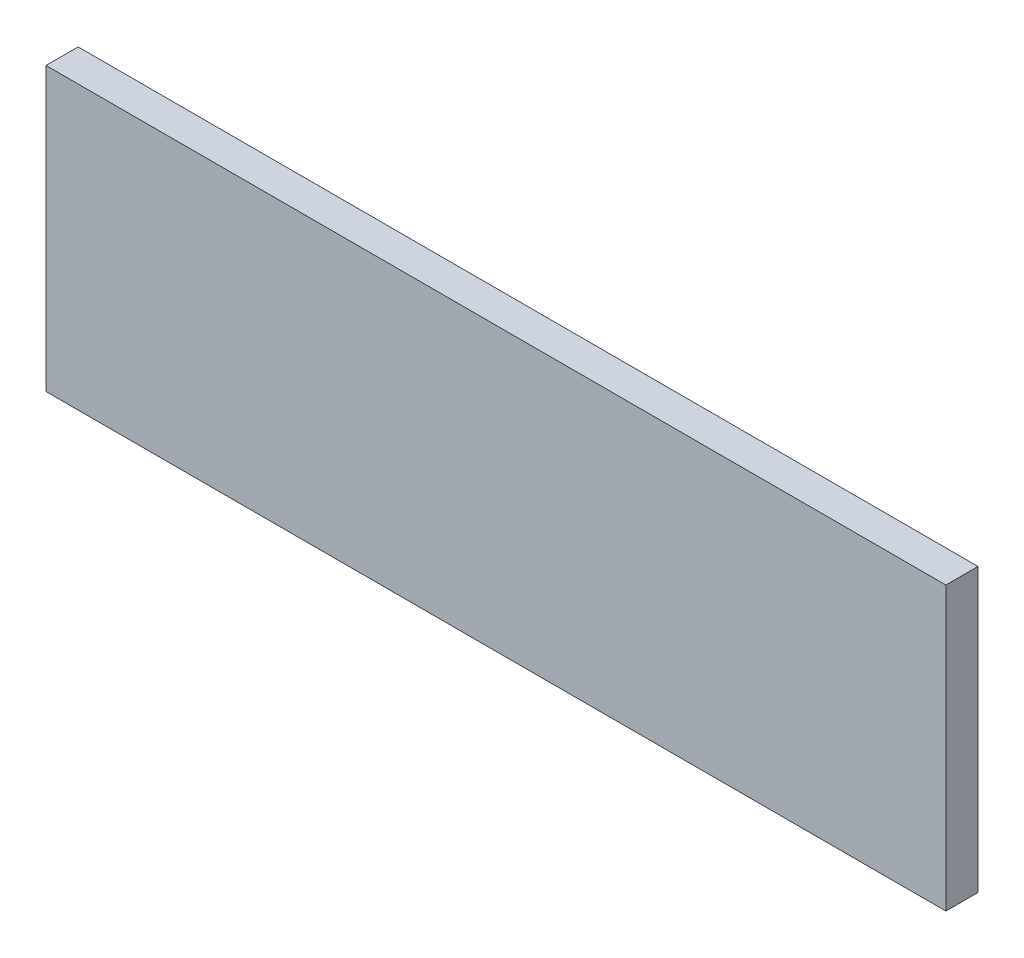
ISO-10303-21;
HEADER;
FILE_DESCRIPTION(('STEP AP214'),'2;1');
FILE_NAME('part.step','',(''),(''),'','','');
FILE_SCHEMA(('AUTOMOTIVE_DESIGN { 1 0 10303 214 1 1 1 1 }'));
ENDSEC;
DATA;
#1=APPLICATION_CONTEXT('core data for automotive mechanical design processes');
#2=APPLICATION_PROTOCOL_DEFINITION('international standard','automotive_design',2000,#1);
#3=PRODUCT_CONTEXT('',#1,'mechanical');
#4=PRODUCT('Part','Part','',(#3));
#5=PRODUCT_RELATED_PRODUCT_CATEGORY('part','',(#4));
#6=PRODUCT_DEFINITION_FORMATION('','',#4);
#7=PRODUCT_DEFINITION_CONTEXT('part definition',#1,'design');
#8=PRODUCT_DEFINITION('design','',#6,#7);
#9=PRODUCT_DEFINITION_SHAPE('','',#8);
#10=(LENGTH_UNIT() NAMED_UNIT(*) SI_UNIT(.MILLI.,.METRE.));
#11=(NAMED_UNIT(*) PLANE_ANGLE_UNIT() SI_UNIT($,.RADIAN.));
#12=(NAMED_UNIT(*) SI_UNIT($,.STERADIAN.) SOLID_ANGLE_UNIT());
#13=UNCERTAINTY_MEASURE_WITH_UNIT(LENGTH_MEASURE(1.E-05),#10,'distance_accuracy_value','');
#14=(GEOMETRIC_REPRESENTATION_CONTEXT(3) GLOBAL_UNCERTAINTY_ASSIGNED_CONTEXT((#13)) GLOBAL_UNIT_ASSIGNED_CONTEXT((#10,
#11,#12)) REPRESENTATION_CONTEXT('',''));
#15=CARTESIAN_POINT('',(0.,0.,0.));
#16=DIRECTION('',(0.,0.,1.));
#17=DIRECTION('',(1.,0.,0.));
#18=AXIS2_PLACEMENT_3D('',#15,#16,#17);
#19=CARTESIAN_POINT('',(88.8999999999997,-27.9000000000001,3.175));
#20=DIRECTION('',(-1.,0.,0.));
#21=DIRECTION('',(0.,0.,1.));
#22=AXIS2_PLACEMENT_3D('',#19,#20,#21);
#23=PLANE('',#22);
#24=DIRECTION('',(0.,1.,0.));
#25=VECTOR('',#24,1.);
#26=CARTESIAN_POINT('',(88.8999999999997,-27.9000000000001,-3.175));
#27=LINE('',#26,#25);
#28=CARTESIAN_POINT('',(88.8999999999997,-27.9000000000001,-3.175));
#29=VERTEX_POINT('',#28);
#30=CARTESIAN_POINT('',(88.8999999999997,27.8999999999997,-3.175));
#31=VERTEX_POINT('',#30);
#32=EDGE_CURVE('E98',#29,#31,#27,.T.);
#33=ORIENTED_EDGE('',*,*,#32,.T.);
#34=DIRECTION('',(0.,0.,-1.));
#35=VECTOR('',#34,1.);
#36=CARTESIAN_POINT('',(88.8999999999997,27.8999999999997,3.175));
#37=LINE('',#36,#35);
#38=CARTESIAN_POINT('',(88.8999999999997,27.8999999999997,3.175));
#39=VERTEX_POINT('',#38);
#40=EDGE_CURVE('E11',#39,#31,#37,.T.);
#41=ORIENTED_EDGE('',*,*,#40,.F.);
#42=DIRECTION('',(0.,1.,0.));
#43=VECTOR('',#42,1.);
#44=CARTESIAN_POINT('',(88.8999999999997,-27.9000000000001,3.175));
#45=LINE('',#44,#43);
#46=CARTESIAN_POINT('',(88.8999999999997,-27.9000000000001,3.175));
#47=VERTEX_POINT('',#46);
#48=EDGE_CURVE('E86',#47,#39,#45,.T.);
#49=ORIENTED_EDGE('',*,*,#48,.F.);
#50=DIRECTION('',(0.,0.,-1.));
#51=VECTOR('',#50,1.);
#52=CARTESIAN_POINT('',(88.8999999999997,-27.9000000000001,3.175));
#53=LINE('',#52,#51);
#54=EDGE_CURVE('E94',#47,#29,#53,.T.);
#55=ORIENTED_EDGE('',*,*,#54,.T.);
#56=EDGE_LOOP('',(#33,#41,#49,#55));
#57=FACE_BOUND('',#56,.T.);
#58=ADVANCED_FACE('F35',(#57),#23,.F.);
#59=CARTESIAN_POINT('',(-88.9000000000003,27.8999999999997,3.175));
#60=DIRECTION('',(0.,-1.,0.));
#61=DIRECTION('',(0.,0.,-1.));
#62=AXIS2_PLACEMENT_3D('',#59,#60,#61);
#63=PLANE('',#62);
#64=DIRECTION('',(-1.,0.,0.));
#65=VECTOR('',#64,1.);
#66=CARTESIAN_POINT('',(-88.9000000000003,27.8999999999997,-3.175));
#67=LINE('',#66,#65);
#68=CARTESIAN_POINT('',(-88.9000000000003,27.8999999999997,-3.175));
#69=VERTEX_POINT('',#68);
#70=EDGE_CURVE('E90',#31,#69,#67,.T.);
#71=ORIENTED_EDGE('',*,*,#70,.T.);
#72=DIRECTION('',(0.,0.,-1.));
#73=VECTOR('',#72,1.);
#74=CARTESIAN_POINT('',(-88.9000000000003,27.8999999999997,3.175));
#75=LINE('',#74,#73);
#76=CARTESIAN_POINT('',(-88.9000000000003,27.8999999999997,3.175));
#77=VERTEX_POINT('',#76);
#78=EDGE_CURVE('E43',#77,#69,#75,.T.);
#79=ORIENTED_EDGE('',*,*,#78,.F.);
#80=DIRECTION('',(-1.,0.,0.));
#81=VECTOR('',#80,1.);
#82=CARTESIAN_POINT('',(-88.9000000000003,27.8999999999997,3.175));
#83=LINE('',#82,#81);
#84=EDGE_CURVE('E81',#39,#77,#83,.T.);
#85=ORIENTED_EDGE('',*,*,#84,.F.);
#86=ORIENTED_EDGE('',*,*,#40,.T.);
#87=EDGE_LOOP('',(#71,#79,#85,#86));
#88=FACE_BOUND('',#87,.T.);
#89=ADVANCED_FACE('F89',(#88),#63,.F.);
#90=CARTESIAN_POINT('',(-88.9000000000003,-27.9000000000001,3.175));
#91=DIRECTION('',(1.,0.,0.));
#92=DIRECTION('',(0.,0.,-1.));
#93=AXIS2_PLACEMENT_3D('',#90,#91,#92);
#94=PLANE('',#93);
#95=DIRECTION('',(0.,-1.,0.));
#96=VECTOR('',#95,1.);
#97=CARTESIAN_POINT('',(-88.9000000000003,-27.9000000000001,-3.175));
#98=LINE('',#97,#96);
#99=CARTESIAN_POINT('',(-88.9000000000003,-27.9000000000001,-3.175));
#100=VERTEX_POINT('',#99);
#101=EDGE_CURVE('E68',#69,#100,#98,.T.);
#102=ORIENTED_EDGE('',*,*,#101,.T.);
#103=DIRECTION('',(0.,0.,-1.));
#104=VECTOR('',#103,1.);
#105=CARTESIAN_POINT('',(-88.9000000000003,-27.9000000000001,3.175));
#106=LINE('',#105,#104);
#107=CARTESIAN_POINT('',(-88.9000000000003,-27.9000000000001,3.175));
#108=VERTEX_POINT('',#107);
#109=EDGE_CURVE('E91',#108,#100,#106,.T.);
#110=ORIENTED_EDGE('',*,*,#109,.F.);
#111=DIRECTION('',(0.,-1.,0.));
#112=VECTOR('',#111,1.);
#113=CARTESIAN_POINT('',(-88.9000000000003,-27.9000000000001,3.175));
#114=LINE('',#113,#112);
#115=EDGE_CURVE('E84',#77,#108,#114,.T.);
#116=ORIENTED_EDGE('',*,*,#115,.F.);
#117=ORIENTED_EDGE('',*,*,#78,.T.);
#118=EDGE_LOOP('',(#102,#110,#116,#117));
#119=FACE_BOUND('',#118,.T.);
#120=ADVANCED_FACE('F92',(#119),#94,.F.);
#121=CARTESIAN_POINT('',(-88.9000000000003,-27.9000000000001,3.175));
#122=DIRECTION('',(0.,1.,0.));
#123=DIRECTION('',(0.,0.,1.));
#124=AXIS2_PLACEMENT_3D('',#121,#122,#123);
#125=PLANE('',#124);
#126=DIRECTION('',(1.,0.,0.));
#127=VECTOR('',#126,1.);
#128=CARTESIAN_POINT('',(-88.9000000000003,-27.9000000000001,-3.175));
#129=LINE('',#128,#127);
#130=EDGE_CURVE('E74',#100,#29,#129,.T.);
#131=ORIENTED_EDGE('',*,*,#130,.T.);
#132=ORIENTED_EDGE('',*,*,#54,.F.);
#133=DIRECTION('',(1.,0.,0.));
#134=VECTOR('',#133,1.);
#135=CARTESIAN_POINT('',(-88.9000000000003,-27.9000000000001,3.175));
#136=LINE('',#135,#134);
#137=EDGE_CURVE('E51',#108,#47,#136,.T.);
#138=ORIENTED_EDGE('',*,*,#137,.F.);
#139=ORIENTED_EDGE('',*,*,#109,.T.);
#140=EDGE_LOOP('',(#131,#132,#138,#139));
#141=FACE_BOUND('',#140,.T.);
#142=ADVANCED_FACE('F105',(#141),#125,.F.);
#143=CARTESIAN_POINT('',(0.,0.,3.175));
#144=DIRECTION('',(0.,0.,-1.));
#145=DIRECTION('',(-1.,0.,0.));
#146=AXIS2_PLACEMENT_3D('',#143,#144,#145);
#147=PLANE('',#146);
#148=ORIENTED_EDGE('',*,*,#48,.T.);
#149=ORIENTED_EDGE('',*,*,#84,.T.);
#150=ORIENTED_EDGE('',*,*,#115,.T.);
#151=ORIENTED_EDGE('',*,*,#137,.T.);
#152=EDGE_LOOP('',(#148,#149,#150,#151));
#153=FACE_BOUND('',#152,.T.);
#154=ADVANCED_FACE('F82',(#153),#147,.F.);
#155=CARTESIAN_POINT('',(0.,0.,-3.175));
#156=DIRECTION('',(0.,0.,-1.));
#157=DIRECTION('',(-1.,0.,0.));
#158=AXIS2_PLACEMENT_3D('',#155,#156,#157);
#159=PLANE('',#158);
#160=ORIENTED_EDGE('',*,*,#32,.F.);
#161=ORIENTED_EDGE('',*,*,#130,.F.);
#162=ORIENTED_EDGE('',*,*,#101,.F.);
#163=ORIENTED_EDGE('',*,*,#70,.F.);
#164=EDGE_LOOP('',(#160,#161,#162,#163));
#165=FACE_BOUND('',#164,.T.);
#166=ADVANCED_FACE('F108',(#165),#159,.T.);
#167=CLOSED_SHELL('',(#58,#89,#120,#142,#154,#166));
#168=MANIFOLD_SOLID_BREP('B2',#167);
#169=ADVANCED_BREP_SHAPE_REPRESENTATION('',(#18,#168),#14);
#170=SHAPE_DEFINITION_REPRESENTATION(#9,#169);
ENDSEC;
END-ISO-10303-21;
